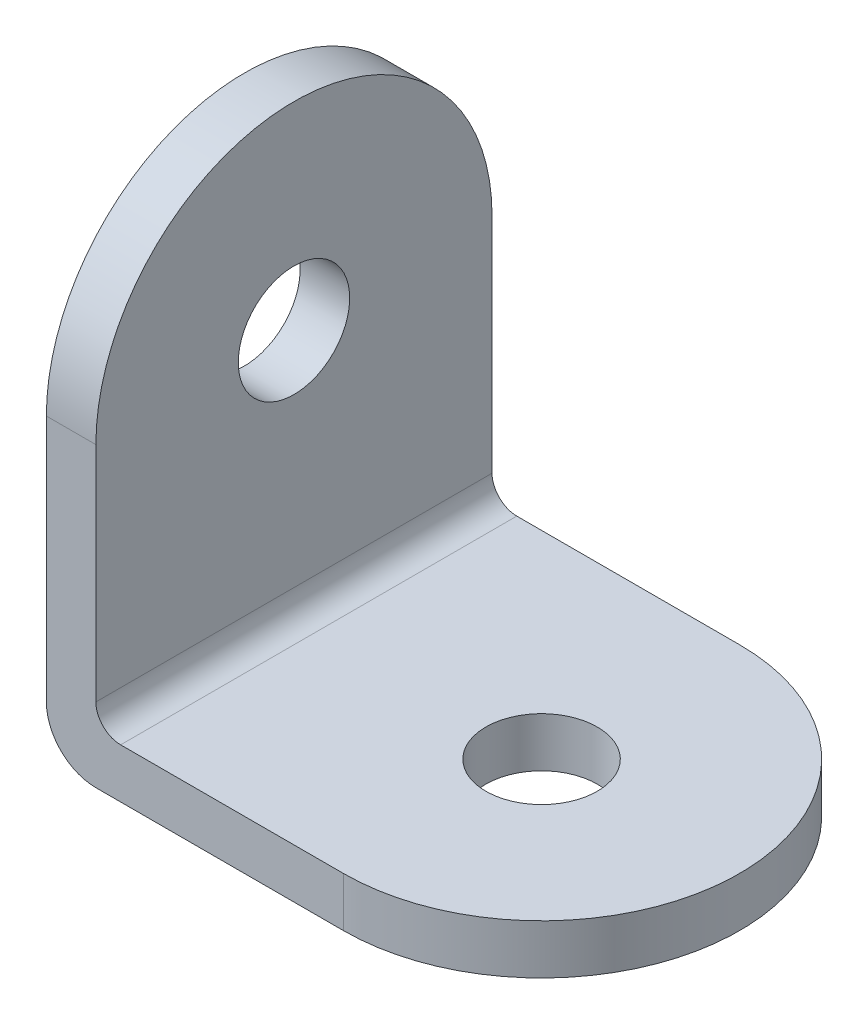
ISO-10303-21;
HEADER;
FILE_DESCRIPTION(('STEP AP214'),'2;1');
FILE_NAME('part.step','',(''),(''),'','','');
FILE_SCHEMA(('AUTOMOTIVE_DESIGN { 1 0 10303 214 1 1 1 1 }'));
ENDSEC;
DATA;
#1=APPLICATION_CONTEXT('core data for automotive mechanical design processes');
#2=APPLICATION_PROTOCOL_DEFINITION('international standard','automotive_design',2000,#1);
#3=PRODUCT_CONTEXT('',#1,'mechanical');
#4=PRODUCT('Part','Part','',(#3));
#5=PRODUCT_RELATED_PRODUCT_CATEGORY('part','',(#4));
#6=PRODUCT_DEFINITION_FORMATION('','',#4);
#7=PRODUCT_DEFINITION_CONTEXT('part definition',#1,'design');
#8=PRODUCT_DEFINITION('design','',#6,#7);
#9=PRODUCT_DEFINITION_SHAPE('','',#8);
#10=(LENGTH_UNIT() NAMED_UNIT(*) SI_UNIT(.MILLI.,.METRE.));
#11=(NAMED_UNIT(*) PLANE_ANGLE_UNIT() SI_UNIT($,.RADIAN.));
#12=(NAMED_UNIT(*) SI_UNIT($,.STERADIAN.) SOLID_ANGLE_UNIT());
#13=UNCERTAINTY_MEASURE_WITH_UNIT(LENGTH_MEASURE(1.E-05),#10,'distance_accuracy_value','');
#14=(GEOMETRIC_REPRESENTATION_CONTEXT(3) GLOBAL_UNCERTAINTY_ASSIGNED_CONTEXT((#13)) GLOBAL_UNIT_ASSIGNED_CONTEXT((#10,
#11,#12)) REPRESENTATION_CONTEXT('',''));
#15=CARTESIAN_POINT('',(0.,0.,0.));
#16=DIRECTION('',(0.,0.,1.));
#17=DIRECTION('',(1.,0.,0.));
#18=AXIS2_PLACEMENT_3D('',#15,#16,#17);
#19=CARTESIAN_POINT('',(2.,20.,16.));
#20=DIRECTION('',(-1.,0.,0.));
#21=DIRECTION('',(0.,-1.,0.));
#22=AXIS2_PLACEMENT_3D('',#19,#20,#21);
#23=PLANE('',#22);
#24=CARTESIAN_POINT('',(2.,12.,8.));
#25=DIRECTION('',(1.,0.,0.));
#26=DIRECTION('',(0.,1.,0.));
#27=AXIS2_PLACEMENT_3D('',#24,#25,#26);
#28=CIRCLE('',#27,2.25);
#29=CARTESIAN_POINT('',(2.,14.25,8.));
#30=VERTEX_POINT('',#29);
#31=EDGE_CURVE('E185',#30,#30,#28,.T.);
#32=ORIENTED_EDGE('',*,*,#31,.F.);
#33=EDGE_LOOP('',(#32));
#34=FACE_BOUND('',#33,.T.);
#35=DIRECTION('',(0.,1.,0.));
#36=VECTOR('',#35,1.);
#37=CARTESIAN_POINT('',(2.,20.,16.));
#38=LINE('',#37,#36);
#39=CARTESIAN_POINT('',(2.,3.,16.));
#40=VERTEX_POINT('',#39);
#41=CARTESIAN_POINT('',(2.,12.,16.));
#42=VERTEX_POINT('',#41);
#43=EDGE_CURVE('E114',#40,#42,#38,.T.);
#44=ORIENTED_EDGE('',*,*,#43,.F.);
#45=DIRECTION('',(0.,0.,-1.));
#46=VECTOR('',#45,1.);
#47=CARTESIAN_POINT('',(2.,3.,0.));
#48=LINE('',#47,#46);
#49=CARTESIAN_POINT('',(2.,3.,0.));
#50=VERTEX_POINT('',#49);
#51=EDGE_CURVE('E141',#40,#50,#48,.T.);
#52=ORIENTED_EDGE('',*,*,#51,.T.);
#53=DIRECTION('',(0.,1.,0.));
#54=VECTOR('',#53,1.);
#55=CARTESIAN_POINT('',(2.,20.,0.));
#56=LINE('',#55,#54);
#57=CARTESIAN_POINT('',(2.,12.,0.));
#58=VERTEX_POINT('',#57);
#59=EDGE_CURVE('E134',#50,#58,#56,.T.);
#60=ORIENTED_EDGE('',*,*,#59,.T.);
#61=CARTESIAN_POINT('',(2.,12.,8.));
#62=DIRECTION('',(-1.,0.,0.));
#63=DIRECTION('',(0.,-1.,0.));
#64=AXIS2_PLACEMENT_3D('',#61,#62,#63);
#65=CIRCLE('',#64,8.);
#66=EDGE_CURVE('E173',#42,#58,#65,.T.);
#67=ORIENTED_EDGE('',*,*,#66,.F.);
#68=EDGE_LOOP('',(#44,#52,#60,#67));
#69=FACE_BOUND('',#68,.T.);
#70=ADVANCED_FACE('F36',(#34,#69),#23,.F.);
#71=CARTESIAN_POINT('',(0.,0.,16.));
#72=DIRECTION('',(1.,0.,0.));
#73=DIRECTION('',(0.,0.,-1.));
#74=AXIS2_PLACEMENT_3D('',#71,#72,#73);
#75=PLANE('',#74);
#76=CARTESIAN_POINT('',(0.,12.,8.));
#77=DIRECTION('',(1.,0.,0.));
#78=DIRECTION('',(0.,1.,0.));
#79=AXIS2_PLACEMENT_3D('',#76,#77,#78);
#80=CIRCLE('',#79,2.25);
#81=CARTESIAN_POINT('',(0.,14.25,8.));
#82=VERTEX_POINT('',#81);
#83=EDGE_CURVE('E116',#82,#82,#80,.T.);
#84=ORIENTED_EDGE('',*,*,#83,.T.);
#85=EDGE_LOOP('',(#84));
#86=FACE_BOUND('',#85,.T.);
#87=DIRECTION('',(0.,-1.,0.));
#88=VECTOR('',#87,1.);
#89=CARTESIAN_POINT('',(0.,0.,0.));
#90=LINE('',#89,#88);
#91=CARTESIAN_POINT('',(0.,12.,0.));
#92=VERTEX_POINT('',#91);
#93=CARTESIAN_POINT('',(0.,2.,0.));
#94=VERTEX_POINT('',#93);
#95=EDGE_CURVE('E136',#92,#94,#90,.T.);
#96=ORIENTED_EDGE('',*,*,#95,.T.);
#97=DIRECTION('',(0.,0.,-1.));
#98=VECTOR('',#97,1.);
#99=CARTESIAN_POINT('',(0.,2.,16.));
#100=LINE('',#99,#98);
#101=CARTESIAN_POINT('',(0.,2.,16.));
#102=VERTEX_POINT('',#101);
#103=EDGE_CURVE('E44',#94,#102,#100,.F.);
#104=ORIENTED_EDGE('',*,*,#103,.T.);
#105=DIRECTION('',(0.,-1.,0.));
#106=VECTOR('',#105,1.);
#107=CARTESIAN_POINT('',(0.,0.,16.));
#108=LINE('',#107,#106);
#109=CARTESIAN_POINT('',(0.,12.,16.));
#110=VERTEX_POINT('',#109);
#111=EDGE_CURVE('E111',#110,#102,#108,.T.);
#112=ORIENTED_EDGE('',*,*,#111,.F.);
#113=CARTESIAN_POINT('',(0.,12.,8.));
#114=DIRECTION('',(-1.,0.,0.));
#115=DIRECTION('',(0.,0.,1.));
#116=AXIS2_PLACEMENT_3D('',#113,#114,#115);
#117=CIRCLE('',#116,8.);
#118=EDGE_CURVE('E101',#110,#92,#117,.T.);
#119=ORIENTED_EDGE('',*,*,#118,.T.);
#120=EDGE_LOOP('',(#96,#104,#112,#119));
#121=FACE_BOUND('',#120,.T.);
#122=ADVANCED_FACE('F118',(#86,#121),#75,.F.);
#123=CARTESIAN_POINT('',(20.,0.,16.));
#124=DIRECTION('',(0.,1.,0.));
#125=DIRECTION('',(-1.,0.,0.));
#126=AXIS2_PLACEMENT_3D('',#123,#124,#125);
#127=PLANE('',#126);
#128=CARTESIAN_POINT('',(12.,0.,8.));
#129=DIRECTION('',(0.,1.,0.));
#130=DIRECTION('',(-1.,0.,0.));
#131=AXIS2_PLACEMENT_3D('',#128,#129,#130);
#132=CIRCLE('',#131,2.25);
#133=CARTESIAN_POINT('',(9.75,0.,8.));
#134=VERTEX_POINT('',#133);
#135=EDGE_CURVE('E188',#134,#134,#132,.T.);
#136=ORIENTED_EDGE('',*,*,#135,.T.);
#137=EDGE_LOOP('',(#136));
#138=FACE_BOUND('',#137,.T.);
#139=DIRECTION('',(1.,0.,0.));
#140=VECTOR('',#139,1.);
#141=CARTESIAN_POINT('',(20.,0.,16.));
#142=LINE('',#141,#140);
#143=CARTESIAN_POINT('',(2.,0.,16.));
#144=VERTEX_POINT('',#143);
#145=CARTESIAN_POINT('',(12.,0.,16.));
#146=VERTEX_POINT('',#145);
#147=EDGE_CURVE('E137',#144,#146,#142,.T.);
#148=ORIENTED_EDGE('',*,*,#147,.F.);
#149=DIRECTION('',(0.,0.,-1.));
#150=VECTOR('',#149,1.);
#151=CARTESIAN_POINT('',(2.,0.,16.));
#152=LINE('',#151,#150);
#153=CARTESIAN_POINT('',(2.,0.,0.));
#154=VERTEX_POINT('',#153);
#155=EDGE_CURVE('E150',#144,#154,#152,.T.);
#156=ORIENTED_EDGE('',*,*,#155,.T.);
#157=DIRECTION('',(1.,0.,0.));
#158=VECTOR('',#157,1.);
#159=CARTESIAN_POINT('',(20.,0.,0.));
#160=LINE('',#159,#158);
#161=CARTESIAN_POINT('',(12.,0.,0.));
#162=VERTEX_POINT('',#161);
#163=EDGE_CURVE('E128',#154,#162,#160,.T.);
#164=ORIENTED_EDGE('',*,*,#163,.T.);
#165=CARTESIAN_POINT('',(12.,0.,8.));
#166=DIRECTION('',(0.,-1.,0.));
#167=DIRECTION('',(1.,0.,0.));
#168=AXIS2_PLACEMENT_3D('',#165,#166,#167);
#169=CIRCLE('',#168,8.);
#170=EDGE_CURVE('E166',#162,#146,#169,.T.);
#171=ORIENTED_EDGE('',*,*,#170,.T.);
#172=EDGE_LOOP('',(#148,#156,#164,#171));
#173=FACE_BOUND('',#172,.T.);
#174=ADVANCED_FACE('F156',(#138,#173),#127,.F.);
#175=CARTESIAN_POINT('',(2.,2.,16.));
#176=DIRECTION('',(0.,-1.,0.));
#177=DIRECTION('',(1.,0.,0.));
#178=AXIS2_PLACEMENT_3D('',#175,#176,#177);
#179=PLANE('',#178);
#180=CARTESIAN_POINT('',(12.,2.,8.));
#181=DIRECTION('',(0.,1.,0.));
#182=DIRECTION('',(-1.,0.,0.));
#183=AXIS2_PLACEMENT_3D('',#180,#181,#182);
#184=CIRCLE('',#183,2.25);
#185=CARTESIAN_POINT('',(9.75,2.,8.));
#186=VERTEX_POINT('',#185);
#187=EDGE_CURVE('E191',#186,#186,#184,.T.);
#188=ORIENTED_EDGE('',*,*,#187,.F.);
#189=EDGE_LOOP('',(#188));
#190=FACE_BOUND('',#189,.T.);
#191=DIRECTION('',(-1.,0.,0.));
#192=VECTOR('',#191,1.);
#193=CARTESIAN_POINT('',(2.,2.,0.));
#194=LINE('',#193,#192);
#195=CARTESIAN_POINT('',(12.,2.,0.));
#196=VERTEX_POINT('',#195);
#197=CARTESIAN_POINT('',(3.,2.,0.));
#198=VERTEX_POINT('',#197);
#199=EDGE_CURVE('E130',#196,#198,#194,.T.);
#200=ORIENTED_EDGE('',*,*,#199,.T.);
#201=DIRECTION('',(0.,0.,-1.));
#202=VECTOR('',#201,1.);
#203=CARTESIAN_POINT('',(3.,2.,16.));
#204=LINE('',#203,#202);
#205=CARTESIAN_POINT('',(3.,2.,16.));
#206=VERTEX_POINT('',#205);
#207=EDGE_CURVE('E144',#198,#206,#204,.F.);
#208=ORIENTED_EDGE('',*,*,#207,.T.);
#209=DIRECTION('',(-1.,0.,0.));
#210=VECTOR('',#209,1.);
#211=CARTESIAN_POINT('',(2.,2.,16.));
#212=LINE('',#211,#210);
#213=CARTESIAN_POINT('',(12.,2.,16.));
#214=VERTEX_POINT('',#213);
#215=EDGE_CURVE('E124',#214,#206,#212,.T.);
#216=ORIENTED_EDGE('',*,*,#215,.F.);
#217=CARTESIAN_POINT('',(12.,2.,8.));
#218=DIRECTION('',(0.,-1.,0.));
#219=DIRECTION('',(1.,0.,0.));
#220=AXIS2_PLACEMENT_3D('',#217,#218,#219);
#221=CIRCLE('',#220,8.);
#222=EDGE_CURVE('E131',#196,#214,#221,.T.);
#223=ORIENTED_EDGE('',*,*,#222,.F.);
#224=EDGE_LOOP('',(#200,#208,#216,#223));
#225=FACE_BOUND('',#224,.T.);
#226=ADVANCED_FACE('F169',(#190,#225),#179,.F.);
#227=CARTESIAN_POINT('',(0.,0.,16.));
#228=DIRECTION('',(0.,0.,-1.));
#229=DIRECTION('',(-1.,0.,0.));
#230=AXIS2_PLACEMENT_3D('',#227,#228,#229);
#231=PLANE('',#230);
#232=ORIENTED_EDGE('',*,*,#111,.T.);
#233=CARTESIAN_POINT('',(2.,2.,16.));
#234=DIRECTION('',(0.,0.,-1.));
#235=DIRECTION('',(-1.,0.,0.));
#236=AXIS2_PLACEMENT_3D('',#233,#234,#235);
#237=CIRCLE('',#236,2.);
#238=EDGE_CURVE('E11',#102,#144,#237,.F.);
#239=ORIENTED_EDGE('',*,*,#238,.T.);
#240=ORIENTED_EDGE('',*,*,#147,.T.);
#241=DIRECTION('',(0.,-1.,0.));
#242=VECTOR('',#241,1.);
#243=CARTESIAN_POINT('',(12.,20.,16.));
#244=LINE('',#243,#242);
#245=EDGE_CURVE('E122',#214,#146,#244,.T.);
#246=ORIENTED_EDGE('',*,*,#245,.F.);
#247=ORIENTED_EDGE('',*,*,#215,.T.);
#248=CARTESIAN_POINT('',(3.,3.,16.));
#249=DIRECTION('',(0.,0.,-1.));
#250=DIRECTION('',(-1.,0.,0.));
#251=AXIS2_PLACEMENT_3D('',#248,#249,#250);
#252=CIRCLE('',#251,1.);
#253=EDGE_CURVE('E148',#206,#40,#252,.T.);
#254=ORIENTED_EDGE('',*,*,#253,.T.);
#255=ORIENTED_EDGE('',*,*,#43,.T.);
#256=DIRECTION('',(-1.,0.,0.));
#257=VECTOR('',#256,1.);
#258=CARTESIAN_POINT('',(20.,12.,16.));
#259=LINE('',#258,#257);
#260=EDGE_CURVE('E105',#42,#110,#259,.T.);
#261=ORIENTED_EDGE('',*,*,#260,.T.);
#262=EDGE_LOOP('',(#232,#239,#240,#246,#247,#254,#255,#261));
#263=FACE_BOUND('',#262,.T.);
#264=ADVANCED_FACE('F110',(#263),#231,.F.);
#265=CARTESIAN_POINT('',(0.,0.,0.));
#266=DIRECTION('',(0.,0.,-1.));
#267=DIRECTION('',(-1.,0.,0.));
#268=AXIS2_PLACEMENT_3D('',#265,#266,#267);
#269=PLANE('',#268);
#270=ORIENTED_EDGE('',*,*,#163,.F.);
#271=CARTESIAN_POINT('',(2.,2.,0.));
#272=DIRECTION('',(0.,0.,-1.));
#273=DIRECTION('',(-1.,0.,0.));
#274=AXIS2_PLACEMENT_3D('',#271,#272,#273);
#275=CIRCLE('',#274,2.);
#276=EDGE_CURVE('E58',#154,#94,#275,.T.);
#277=ORIENTED_EDGE('',*,*,#276,.T.);
#278=ORIENTED_EDGE('',*,*,#95,.F.);
#279=DIRECTION('',(-1.,0.,0.));
#280=VECTOR('',#279,1.);
#281=CARTESIAN_POINT('',(20.,12.,0.));
#282=LINE('',#281,#280);
#283=EDGE_CURVE('E107',#58,#92,#282,.T.);
#284=ORIENTED_EDGE('',*,*,#283,.F.);
#285=ORIENTED_EDGE('',*,*,#59,.F.);
#286=CARTESIAN_POINT('',(3.,3.,0.));
#287=DIRECTION('',(0.,0.,-1.));
#288=DIRECTION('',(-1.,0.,0.));
#289=AXIS2_PLACEMENT_3D('',#286,#287,#288);
#290=CIRCLE('',#289,1.);
#291=EDGE_CURVE('E146',#50,#198,#290,.F.);
#292=ORIENTED_EDGE('',*,*,#291,.T.);
#293=ORIENTED_EDGE('',*,*,#199,.F.);
#294=DIRECTION('',(0.,-1.,0.));
#295=VECTOR('',#294,1.);
#296=CARTESIAN_POINT('',(12.,20.,0.));
#297=LINE('',#296,#295);
#298=EDGE_CURVE('E119',#196,#162,#297,.T.);
#299=ORIENTED_EDGE('',*,*,#298,.T.);
#300=EDGE_LOOP('',(#270,#277,#278,#284,#285,#292,#293,#299));
#301=FACE_BOUND('',#300,.T.);
#302=ADVANCED_FACE('F160',(#301),#269,.T.);
#303=CARTESIAN_POINT('',(12.,20.,8.));
#304=DIRECTION('',(0.,-1.,0.));
#305=DIRECTION('',(1.,0.,0.));
#306=AXIS2_PLACEMENT_3D('',#303,#304,#305);
#307=CYLINDRICAL_SURFACE('',#306,8.);
#308=ORIENTED_EDGE('',*,*,#222,.T.);
#309=ORIENTED_EDGE('',*,*,#245,.T.);
#310=ORIENTED_EDGE('',*,*,#170,.F.);
#311=ORIENTED_EDGE('',*,*,#298,.F.);
#312=EDGE_LOOP('',(#308,#309,#310,#311));
#313=FACE_BOUND('',#312,.T.);
#314=ADVANCED_FACE('F164',(#313),#307,.T.);
#315=CARTESIAN_POINT('',(20.,12.,8.));
#316=DIRECTION('',(-1.,0.,0.));
#317=DIRECTION('',(0.,0.,1.));
#318=AXIS2_PLACEMENT_3D('',#315,#316,#317);
#319=CYLINDRICAL_SURFACE('',#318,8.);
#320=ORIENTED_EDGE('',*,*,#66,.T.);
#321=ORIENTED_EDGE('',*,*,#283,.T.);
#322=ORIENTED_EDGE('',*,*,#118,.F.);
#323=ORIENTED_EDGE('',*,*,#260,.F.);
#324=EDGE_LOOP('',(#320,#321,#322,#323));
#325=FACE_BOUND('',#324,.T.);
#326=ADVANCED_FACE('F104',(#325),#319,.T.);
#327=CARTESIAN_POINT('',(3.,3.,16.));
#328=DIRECTION('',(0.,0.,1.));
#329=DIRECTION('',(1.,0.,0.));
#330=AXIS2_PLACEMENT_3D('',#327,#328,#329);
#331=CYLINDRICAL_SURFACE('',#330,1.);
#332=ORIENTED_EDGE('',*,*,#253,.F.);
#333=ORIENTED_EDGE('',*,*,#207,.F.);
#334=ORIENTED_EDGE('',*,*,#291,.F.);
#335=ORIENTED_EDGE('',*,*,#51,.F.);
#336=EDGE_LOOP('',(#332,#333,#334,#335));
#337=FACE_BOUND('',#336,.T.);
#338=ADVANCED_FACE('F180',(#337),#331,.F.);
#339=CARTESIAN_POINT('',(2.,2.,16.));
#340=DIRECTION('',(0.,0.,-1.));
#341=DIRECTION('',(-1.,0.,0.));
#342=AXIS2_PLACEMENT_3D('',#339,#340,#341);
#343=CYLINDRICAL_SURFACE('',#342,2.);
#344=ORIENTED_EDGE('',*,*,#238,.F.);
#345=ORIENTED_EDGE('',*,*,#103,.F.);
#346=ORIENTED_EDGE('',*,*,#276,.F.);
#347=ORIENTED_EDGE('',*,*,#155,.F.);
#348=EDGE_LOOP('',(#344,#345,#346,#347));
#349=FACE_BOUND('',#348,.T.);
#350=ADVANCED_FACE('F38',(#349),#343,.T.);
#351=CARTESIAN_POINT('',(0.,12.,8.));
#352=DIRECTION('',(1.,0.,0.));
#353=DIRECTION('',(0.,1.,0.));
#354=AXIS2_PLACEMENT_3D('',#351,#352,#353);
#355=CYLINDRICAL_SURFACE('',#354,2.25);
#356=ORIENTED_EDGE('',*,*,#83,.F.);
#357=EDGE_LOOP('',(#356));
#358=FACE_BOUND('',#357,.T.);
#359=ORIENTED_EDGE('',*,*,#31,.T.);
#360=EDGE_LOOP('',(#359));
#361=FACE_BOUND('',#360,.T.);
#362=ADVANCED_FACE('F201',(#358,#361),#355,.F.);
#363=CARTESIAN_POINT('',(12.,0.,8.));
#364=DIRECTION('',(0.,1.,0.));
#365=DIRECTION('',(-1.,0.,0.));
#366=AXIS2_PLACEMENT_3D('',#363,#364,#365);
#367=CYLINDRICAL_SURFACE('',#366,2.25);
#368=ORIENTED_EDGE('',*,*,#135,.F.);
#369=EDGE_LOOP('',(#368));
#370=FACE_BOUND('',#369,.T.);
#371=ORIENTED_EDGE('',*,*,#187,.T.);
#372=EDGE_LOOP('',(#371));
#373=FACE_BOUND('',#372,.T.);
#374=ADVANCED_FACE('F198',(#370,#373),#367,.F.);
#375=CLOSED_SHELL('',(#70,#122,#174,#226,#264,#302,#314,#326,#338,#350,#362,#374));
#376=MANIFOLD_SOLID_BREP('B2',#375);
#377=ADVANCED_BREP_SHAPE_REPRESENTATION('',(#18,#376),#14);
#378=SHAPE_DEFINITION_REPRESENTATION(#9,#377);
ENDSEC;
END-ISO-10303-21;
